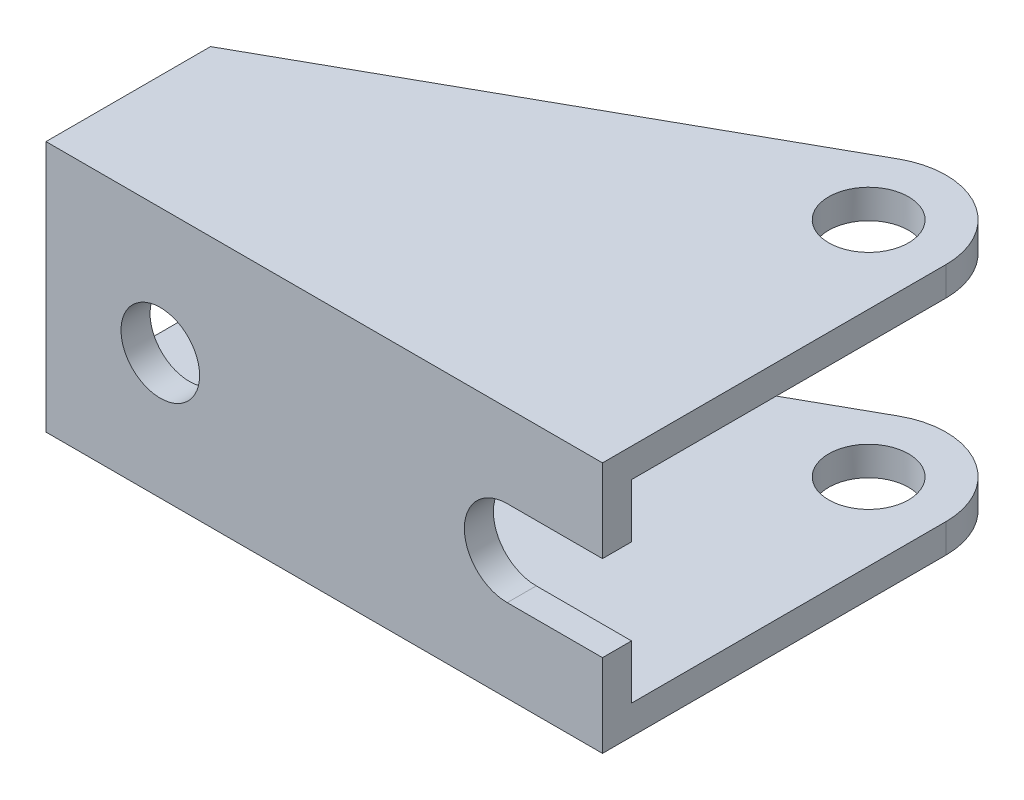
ISO-10303-21;
HEADER;
FILE_DESCRIPTION(('STEP AP214'),'2;1');
FILE_NAME('part.step','',(''),(''),'','','');
FILE_SCHEMA(('AUTOMOTIVE_DESIGN { 1 0 10303 214 1 1 1 1 }'));
ENDSEC;
DATA;
#1=APPLICATION_CONTEXT('core data for automotive mechanical design processes');
#2=APPLICATION_PROTOCOL_DEFINITION('international standard','automotive_design',2000,#1);
#3=PRODUCT_CONTEXT('',#1,'mechanical');
#4=PRODUCT('Part','Part','',(#3));
#5=PRODUCT_RELATED_PRODUCT_CATEGORY('part','',(#4));
#6=PRODUCT_DEFINITION_FORMATION('','',#4);
#7=PRODUCT_DEFINITION_CONTEXT('part definition',#1,'design');
#8=PRODUCT_DEFINITION('design','',#6,#7);
#9=PRODUCT_DEFINITION_SHAPE('','',#8);
#10=(LENGTH_UNIT() NAMED_UNIT(*) SI_UNIT(.MILLI.,.METRE.));
#11=(NAMED_UNIT(*) PLANE_ANGLE_UNIT() SI_UNIT($,.RADIAN.));
#12=(NAMED_UNIT(*) SI_UNIT($,.STERADIAN.) SOLID_ANGLE_UNIT());
#13=UNCERTAINTY_MEASURE_WITH_UNIT(LENGTH_MEASURE(1.E-05),#10,'distance_accuracy_value','');
#14=(GEOMETRIC_REPRESENTATION_CONTEXT(3) GLOBAL_UNCERTAINTY_ASSIGNED_CONTEXT((#13)) GLOBAL_UNIT_ASSIGNED_CONTEXT((#10,
#11,#12)) REPRESENTATION_CONTEXT('',''));
#15=CARTESIAN_POINT('',(0.,0.,0.));
#16=DIRECTION('',(0.,0.,1.));
#17=DIRECTION('',(1.,0.,0.));
#18=AXIS2_PLACEMENT_3D('',#15,#16,#17);
#19=CARTESIAN_POINT('',(0.,-26.416,0.));
#20=DIRECTION('',(-1.,0.,0.));
#21=DIRECTION('',(0.,0.,1.));
#22=AXIS2_PLACEMENT_3D('',#19,#20,#21);
#23=PLANE('',#22);
#24=DIRECTION('',(0.,0.,1.));
#25=VECTOR('',#24,1.);
#26=CARTESIAN_POINT('',(0.,-17.708,-44.197));
#27=LINE('',#26,#25);
#28=CARTESIAN_POINT('',(0.,-17.708,-3.048));
#29=VERTEX_POINT('',#28);
#30=CARTESIAN_POINT('',(0.,-17.708,0.));
#31=VERTEX_POINT('',#30);
#32=EDGE_CURVE('E148',#29,#31,#27,.T.);
#33=ORIENTED_EDGE('',*,*,#32,.T.);
#34=DIRECTION('',(0.,1.,0.));
#35=VECTOR('',#34,1.);
#36=CARTESIAN_POINT('',(0.,-26.416,0.));
#37=LINE('',#36,#35);
#38=CARTESIAN_POINT('',(0.,-26.416,0.));
#39=VERTEX_POINT('',#38);
#40=EDGE_CURVE('E11',#39,#31,#37,.T.);
#41=ORIENTED_EDGE('',*,*,#40,.F.);
#42=DIRECTION('',(0.,0.,1.));
#43=VECTOR('',#42,1.);
#44=CARTESIAN_POINT('',(0.,-26.416,0.));
#45=LINE('',#44,#43);
#46=CARTESIAN_POINT('',(0.,-26.416,-36.068));
#47=VERTEX_POINT('',#46);
#48=EDGE_CURVE('E179',#47,#39,#45,.T.);
#49=ORIENTED_EDGE('',*,*,#48,.F.);
#50=DIRECTION('',(0.,1.,0.));
#51=VECTOR('',#50,1.);
#52=CARTESIAN_POINT('',(0.,-26.416,-36.068));
#53=LINE('',#52,#51);
#54=CARTESIAN_POINT('',(0.,-23.368,-36.068));
#55=VERTEX_POINT('',#54);
#56=EDGE_CURVE('E39',#47,#55,#53,.T.);
#57=ORIENTED_EDGE('',*,*,#56,.T.);
#58=DIRECTION('',(0.,0.,-1.));
#59=VECTOR('',#58,1.);
#60=CARTESIAN_POINT('',(0.,-23.368,-3.048));
#61=LINE('',#60,#59);
#62=CARTESIAN_POINT('',(0.,-23.368,-3.048));
#63=VERTEX_POINT('',#62);
#64=EDGE_CURVE('E60',#63,#55,#61,.T.);
#65=ORIENTED_EDGE('',*,*,#64,.F.);
#66=DIRECTION('',(0.,-1.,0.));
#67=VECTOR('',#66,1.);
#68=CARTESIAN_POINT('',(0.,-3.048,-3.048));
#69=LINE('',#68,#67);
#70=EDGE_CURVE('E163',#29,#63,#69,.T.);
#71=ORIENTED_EDGE('',*,*,#70,.F.);
#72=EDGE_LOOP('',(#33,#41,#49,#57,#65,#71));
#73=FACE_BOUND('',#72,.T.);
#74=ADVANCED_FACE('F35',(#73),#23,.F.);
#75=CARTESIAN_POINT('',(0.,-26.416,0.));
#76=DIRECTION('',(0.,0.,-1.));
#77=DIRECTION('',(-1.,0.,0.));
#78=AXIS2_PLACEMENT_3D('',#75,#76,#77);
#79=PLANE('',#78);
#80=CARTESIAN_POINT('',(-46.42,-13.208,0.));
#81=DIRECTION('',(0.,0.,1.));
#82=DIRECTION('',(1.,0.,0.));
#83=AXIS2_PLACEMENT_3D('',#80,#81,#82);
#84=CIRCLE('',#83,4.12500000000001);
#85=CARTESIAN_POINT('',(-42.295,-13.208,0.));
#86=VERTEX_POINT('',#85);
#87=EDGE_CURVE('E340',#86,#86,#84,.T.);
#88=ORIENTED_EDGE('',*,*,#87,.F.);
#89=EDGE_LOOP('',(#88));
#90=FACE_BOUND('',#89,.T.);
#91=DIRECTION('',(-1.,0.,0.));
#92=VECTOR('',#91,1.);
#93=CARTESIAN_POINT('',(0.,-17.708,0.));
#94=LINE('',#93,#92);
#95=CARTESIAN_POINT('',(-10.,-17.708,0.));
#96=VERTEX_POINT('',#95);
#97=EDGE_CURVE('E156',#31,#96,#94,.T.);
#98=ORIENTED_EDGE('',*,*,#97,.T.);
#99=CARTESIAN_POINT('',(-10.,-13.208,0.));
#100=DIRECTION('',(0.,0.,1.));
#101=DIRECTION('',(1.,0.,0.));
#102=AXIS2_PLACEMENT_3D('',#99,#100,#101);
#103=CIRCLE('',#102,4.5);
#104=CARTESIAN_POINT('',(-10.,-8.708,0.));
#105=VERTEX_POINT('',#104);
#106=EDGE_CURVE('E325',#105,#96,#103,.T.);
#107=ORIENTED_EDGE('',*,*,#106,.F.);
#108=DIRECTION('',(-1.,0.,0.));
#109=VECTOR('',#108,1.);
#110=CARTESIAN_POINT('',(0.,-8.708,0.));
#111=LINE('',#110,#109);
#112=CARTESIAN_POINT('',(0.,-8.708,0.));
#113=VERTEX_POINT('',#112);
#114=EDGE_CURVE('E323',#113,#105,#111,.T.);
#115=ORIENTED_EDGE('',*,*,#114,.F.);
#116=CARTESIAN_POINT('',(0.,0.,0.));
#117=VERTEX_POINT('',#116);
#118=EDGE_CURVE('E44',#113,#117,#37,.T.);
#119=ORIENTED_EDGE('',*,*,#118,.T.);
#120=DIRECTION('',(-1.,0.,0.));
#121=VECTOR('',#120,1.);
#122=CARTESIAN_POINT('',(0.,0.,0.));
#123=LINE('',#122,#121);
#124=CARTESIAN_POINT('',(-58.42,0.,0.));
#125=VERTEX_POINT('',#124);
#126=EDGE_CURVE('E206',#117,#125,#123,.T.);
#127=ORIENTED_EDGE('',*,*,#126,.T.);
#128=DIRECTION('',(0.,1.,0.));
#129=VECTOR('',#128,1.);
#130=CARTESIAN_POINT('',(-58.42,-26.416,0.));
#131=LINE('',#130,#129);
#132=CARTESIAN_POINT('',(-58.42,-26.416,0.));
#133=VERTEX_POINT('',#132);
#134=EDGE_CURVE('E210',#133,#125,#131,.T.);
#135=ORIENTED_EDGE('',*,*,#134,.F.);
#136=DIRECTION('',(-1.,0.,0.));
#137=VECTOR('',#136,1.);
#138=CARTESIAN_POINT('',(0.,-26.416,0.));
#139=LINE('',#138,#137);
#140=EDGE_CURVE('E190',#39,#133,#139,.T.);
#141=ORIENTED_EDGE('',*,*,#140,.F.);
#142=ORIENTED_EDGE('',*,*,#40,.T.);
#143=EDGE_LOOP('',(#98,#107,#115,#119,#127,#135,#141,#142));
#144=FACE_BOUND('',#143,.T.);
#145=ADVANCED_FACE('F255',(#90,#144),#79,.F.);
#146=CARTESIAN_POINT('',(-58.421,-3.048,-3.048));
#147=DIRECTION('',(0.,0.,1.));
#148=DIRECTION('',(0.,-1.,0.));
#149=AXIS2_PLACEMENT_3D('',#146,#147,#148);
#150=PLANE('',#149);
#151=CARTESIAN_POINT('',(-46.42,-13.208,-3.048));
#152=DIRECTION('',(0.,0.,1.));
#153=DIRECTION('',(0.,-1.,0.));
#154=AXIS2_PLACEMENT_3D('',#151,#152,#153);
#155=CIRCLE('',#154,4.12500000000001);
#156=CARTESIAN_POINT('',(-46.42,-17.333,-3.048));
#157=VERTEX_POINT('',#156);
#158=EDGE_CURVE('E337',#157,#157,#155,.F.);
#159=ORIENTED_EDGE('',*,*,#158,.F.);
#160=EDGE_LOOP('',(#159));
#161=FACE_BOUND('',#160,.T.);
#162=DIRECTION('',(1.,0.,0.));
#163=VECTOR('',#162,1.);
#164=CARTESIAN_POINT('',(0.,-17.708,-3.048));
#165=LINE('',#164,#163);
#166=CARTESIAN_POINT('',(-10.,-17.708,-3.048));
#167=VERTEX_POINT('',#166);
#168=EDGE_CURVE('E326',#167,#29,#165,.T.);
#169=ORIENTED_EDGE('',*,*,#168,.T.);
#170=ORIENTED_EDGE('',*,*,#70,.T.);
#171=DIRECTION('',(1.,0.,0.));
#172=VECTOR('',#171,1.);
#173=CARTESIAN_POINT('',(-58.421,-23.368,-3.048));
#174=LINE('',#173,#172);
#175=CARTESIAN_POINT('',(-58.42,-23.368,-3.048));
#176=VERTEX_POINT('',#175);
#177=EDGE_CURVE('E165',#176,#63,#174,.T.);
#178=ORIENTED_EDGE('',*,*,#177,.F.);
#179=DIRECTION('',(0.,1.,0.));
#180=VECTOR('',#179,1.);
#181=CARTESIAN_POINT('',(-58.42,-3.048,-3.048));
#182=LINE('',#181,#180);
#183=CARTESIAN_POINT('',(-58.42,-3.048,-3.048));
#184=VERTEX_POINT('',#183);
#185=EDGE_CURVE('E171',#176,#184,#182,.T.);
#186=ORIENTED_EDGE('',*,*,#185,.T.);
#187=DIRECTION('',(1.,0.,0.));
#188=VECTOR('',#187,1.);
#189=CARTESIAN_POINT('',(-58.421,-3.048,-3.048));
#190=LINE('',#189,#188);
#191=CARTESIAN_POINT('',(0.,-3.048,-3.048));
#192=VERTEX_POINT('',#191);
#193=EDGE_CURVE('E161',#184,#192,#190,.T.);
#194=ORIENTED_EDGE('',*,*,#193,.T.);
#195=CARTESIAN_POINT('',(0.,-8.708,-3.048));
#196=VERTEX_POINT('',#195);
#197=EDGE_CURVE('E154',#192,#196,#69,.T.);
#198=ORIENTED_EDGE('',*,*,#197,.T.);
#199=DIRECTION('',(1.,0.,0.));
#200=VECTOR('',#199,1.);
#201=CARTESIAN_POINT('',(0.,-8.708,-3.048));
#202=LINE('',#201,#200);
#203=CARTESIAN_POINT('',(-9.99999999999999,-8.708,-3.048));
#204=VERTEX_POINT('',#203);
#205=EDGE_CURVE('E138',#204,#196,#202,.T.);
#206=ORIENTED_EDGE('',*,*,#205,.F.);
#207=CARTESIAN_POINT('',(-10.,-13.208,-3.048));
#208=DIRECTION('',(0.,0.,1.));
#209=DIRECTION('',(0.,-1.,0.));
#210=AXIS2_PLACEMENT_3D('',#207,#208,#209);
#211=CIRCLE('',#210,4.5);
#212=EDGE_CURVE('E52',#167,#204,#211,.F.);
#213=ORIENTED_EDGE('',*,*,#212,.F.);
#214=EDGE_LOOP('',(#169,#170,#178,#186,#194,#198,#206,#213));
#215=FACE_BOUND('',#214,.T.);
#216=ADVANCED_FACE('F159',(#161,#215),#150,.F.);
#217=ORIENTED_EDGE('',*,*,#118,.F.);
#218=DIRECTION('',(0.,0.,1.));
#219=VECTOR('',#218,1.);
#220=CARTESIAN_POINT('',(0.,-8.708,-44.197));
#221=LINE('',#220,#219);
#222=EDGE_CURVE('E142',#196,#113,#221,.T.);
#223=ORIENTED_EDGE('',*,*,#222,.F.);
#224=ORIENTED_EDGE('',*,*,#197,.F.);
#225=DIRECTION('',(0.,0.,-1.));
#226=VECTOR('',#225,1.);
#227=CARTESIAN_POINT('',(0.,-3.048,-3.048));
#228=LINE('',#227,#226);
#229=CARTESIAN_POINT('',(0.,-3.048,-36.068));
#230=VERTEX_POINT('',#229);
#231=EDGE_CURVE('E230',#192,#230,#228,.T.);
#232=ORIENTED_EDGE('',*,*,#231,.T.);
#233=CARTESIAN_POINT('',(0.,0.,-36.068));
#234=VERTEX_POINT('',#233);
#235=EDGE_CURVE('E195',#230,#234,#53,.T.);
#236=ORIENTED_EDGE('',*,*,#235,.T.);
#237=DIRECTION('',(0.,0.,1.));
#238=VECTOR('',#237,1.);
#239=CARTESIAN_POINT('',(0.,0.,0.));
#240=LINE('',#239,#238);
#241=EDGE_CURVE('E178',#234,#117,#240,.T.);
#242=ORIENTED_EDGE('',*,*,#241,.T.);
#243=EDGE_LOOP('',(#217,#223,#224,#232,#236,#242));
#244=FACE_BOUND('',#243,.T.);
#245=ADVANCED_FACE('F37',(#244),#23,.F.);
#246=CARTESIAN_POINT('',(-58.42,-26.416,0.));
#247=DIRECTION('',(1.,0.,0.));
#248=DIRECTION('',(0.,0.,-1.));
#249=AXIS2_PLACEMENT_3D('',#246,#247,#248);
#250=PLANE('',#249);
#251=DIRECTION('',(0.,0.,1.));
#252=VECTOR('',#251,1.);
#253=CARTESIAN_POINT('',(-58.42,-3.048,-3.048));
#254=LINE('',#253,#252);
#255=CARTESIAN_POINT('',(-58.42,-3.04800000000001,-17.272));
#256=VERTEX_POINT('',#255);
#257=EDGE_CURVE('E305',#256,#184,#254,.T.);
#258=ORIENTED_EDGE('',*,*,#257,.T.);
#259=ORIENTED_EDGE('',*,*,#185,.F.);
#260=DIRECTION('',(0.,0.,1.));
#261=VECTOR('',#260,1.);
#262=CARTESIAN_POINT('',(-58.42,-23.368,-3.048));
#263=LINE('',#262,#261);
#264=CARTESIAN_POINT('',(-58.42,-23.368,-17.272));
#265=VERTEX_POINT('',#264);
#266=EDGE_CURVE('E303',#265,#176,#263,.T.);
#267=ORIENTED_EDGE('',*,*,#266,.F.);
#268=DIRECTION('',(0.,1.,0.));
#269=VECTOR('',#268,1.);
#270=CARTESIAN_POINT('',(-58.42,-26.416,-17.272));
#271=LINE('',#270,#269);
#272=CARTESIAN_POINT('',(-58.42,-26.416,-17.272));
#273=VERTEX_POINT('',#272);
#274=EDGE_CURVE('E213',#273,#265,#271,.T.);
#275=ORIENTED_EDGE('',*,*,#274,.F.);
#276=DIRECTION('',(0.,0.,-1.));
#277=VECTOR('',#276,1.);
#278=CARTESIAN_POINT('',(-58.42,-26.416,0.));
#279=LINE('',#278,#277);
#280=EDGE_CURVE('E188',#133,#273,#279,.T.);
#281=ORIENTED_EDGE('',*,*,#280,.F.);
#282=ORIENTED_EDGE('',*,*,#134,.T.);
#283=DIRECTION('',(0.,0.,-1.));
#284=VECTOR('',#283,1.);
#285=CARTESIAN_POINT('',(-58.42,0.,0.));
#286=LINE('',#285,#284);
#287=CARTESIAN_POINT('',(-58.42,0.,-17.272));
#288=VERTEX_POINT('',#287);
#289=EDGE_CURVE('E203',#125,#288,#286,.T.);
#290=ORIENTED_EDGE('',*,*,#289,.T.);
#291=EDGE_CURVE('E215',#256,#288,#271,.T.);
#292=ORIENTED_EDGE('',*,*,#291,.F.);
#293=EDGE_LOOP('',(#258,#259,#267,#275,#281,#282,#290,#292));
#294=FACE_BOUND('',#293,.T.);
#295=ADVANCED_FACE('F250',(#294),#250,.F.);
#296=CARTESIAN_POINT('',(-21.2598914592036,-26.416,-38.0400876442299));
#297=DIRECTION('',(0.487859747744784,0.,0.872922027749556));
#298=DIRECTION('',(0.872922027749556,0.,-0.487859747744784));
#299=AXIS2_PLACEMENT_3D('',#296,#297,#298);
#300=PLANE('',#299);
#301=DIRECTION('',(-0.872922027749556,0.,0.487859747744784));
#302=VECTOR('',#301,1.);
#303=CARTESIAN_POINT('',(-64.4782447050272,-3.048,-13.8861606700081));
#304=LINE('',#303,#302);
#305=CARTESIAN_POINT('',(-12.0933240296696,-3.04800000000001,-43.1631102415484));
#306=VERTEX_POINT('',#305);
#307=EDGE_CURVE('E315',#306,#256,#304,.T.);
#308=ORIENTED_EDGE('',*,*,#307,.T.);
#309=ORIENTED_EDGE('',*,*,#291,.T.);
#310=DIRECTION('',(0.872922027749556,0.,-0.487859747744784));
#311=VECTOR('',#310,1.);
#312=CARTESIAN_POINT('',(-21.2598914592036,0.,-38.0400876442299));
#313=LINE('',#312,#311);
#314=CARTESIAN_POINT('',(-12.0933240296696,0.,-43.1631102415484));
#315=VERTEX_POINT('',#314);
#316=EDGE_CURVE('E200',#288,#315,#313,.T.);
#317=ORIENTED_EDGE('',*,*,#316,.T.);
#318=DIRECTION('',(0.,1.,0.));
#319=VECTOR('',#318,1.);
#320=CARTESIAN_POINT('',(-12.0933240296696,-26.416,-43.1631102415484));
#321=LINE('',#320,#319);
#322=EDGE_CURVE('E218',#306,#315,#321,.T.);
#323=ORIENTED_EDGE('',*,*,#322,.F.);
#324=EDGE_LOOP('',(#308,#309,#317,#323));
#325=FACE_BOUND('',#324,.T.);
#326=ADVANCED_FACE('F240',(#325),#300,.F.);
#327=CARTESIAN_POINT('',(-8.128,-26.416,-36.068));
#328=DIRECTION('',(0.,1.,0.));
#329=DIRECTION('',(0.,0.,1.));
#330=AXIS2_PLACEMENT_3D('',#327,#328,#329);
#331=CYLINDRICAL_SURFACE('',#330,8.128);
#332=ORIENTED_EDGE('',*,*,#235,.F.);
#333=CARTESIAN_POINT('',(-8.128,-3.048,-36.068));
#334=DIRECTION('',(0.,-1.,0.));
#335=DIRECTION('',(0.,0.,-1.));
#336=AXIS2_PLACEMENT_3D('',#333,#334,#335);
#337=CIRCLE('',#336,8.128);
#338=EDGE_CURVE('E306',#306,#230,#337,.T.);
#339=ORIENTED_EDGE('',*,*,#338,.F.);
#340=ORIENTED_EDGE('',*,*,#322,.T.);
#341=CARTESIAN_POINT('',(-8.128,0.,-36.068));
#342=DIRECTION('',(0.,1.,0.));
#343=DIRECTION('',(0.,0.,1.));
#344=AXIS2_PLACEMENT_3D('',#341,#342,#343);
#345=CIRCLE('',#344,8.128);
#346=EDGE_CURVE('E197',#234,#315,#345,.T.);
#347=ORIENTED_EDGE('',*,*,#346,.F.);
#348=EDGE_LOOP('',(#332,#339,#340,#347));
#349=FACE_BOUND('',#348,.T.);
#350=ADVANCED_FACE('F237',(#349),#331,.T.);
#351=CARTESIAN_POINT('',(-8.128,-26.416,-36.068));
#352=DIRECTION('',(0.,1.,0.));
#353=DIRECTION('',(0.,0.,1.));
#354=AXIS2_PLACEMENT_3D('',#351,#352,#353);
#355=CYLINDRICAL_SURFACE('',#354,4.191);
#356=CARTESIAN_POINT('',(-8.128,0.,-36.068));
#357=DIRECTION('',(0.,1.,0.));
#358=DIRECTION('',(0.,0.,1.));
#359=AXIS2_PLACEMENT_3D('',#356,#357,#358);
#360=CIRCLE('',#359,4.191);
#361=CARTESIAN_POINT('',(-8.128,0.,-31.877));
#362=VERTEX_POINT('',#361);
#363=EDGE_CURVE('E183',#362,#362,#360,.T.);
#364=ORIENTED_EDGE('',*,*,#363,.T.);
#365=EDGE_LOOP('',(#364));
#366=FACE_BOUND('',#365,.T.);
#367=CARTESIAN_POINT('',(-8.128,-3.048,-36.068));
#368=DIRECTION('',(0.,-1.,0.));
#369=DIRECTION('',(0.,0.,-1.));
#370=AXIS2_PLACEMENT_3D('',#367,#368,#369);
#371=CIRCLE('',#370,4.191);
#372=CARTESIAN_POINT('',(-8.128,-3.048,-40.259));
#373=VERTEX_POINT('',#372);
#374=EDGE_CURVE('E308',#373,#373,#371,.T.);
#375=ORIENTED_EDGE('',*,*,#374,.T.);
#376=EDGE_LOOP('',(#375));
#377=FACE_BOUND('',#376,.T.);
#378=ADVANCED_FACE('F239',(#366,#377),#355,.F.);
#379=ORIENTED_EDGE('',*,*,#274,.T.);
#380=DIRECTION('',(-0.872922027749556,0.,0.487859747744784));
#381=VECTOR('',#380,1.);
#382=CARTESIAN_POINT('',(-64.4782447050272,-23.368,-13.8861606700081));
#383=LINE('',#382,#381);
#384=CARTESIAN_POINT('',(-12.0933240296696,-23.368,-43.1631102415484));
#385=VERTEX_POINT('',#384);
#386=EDGE_CURVE('E176',#385,#265,#383,.T.);
#387=ORIENTED_EDGE('',*,*,#386,.F.);
#388=CARTESIAN_POINT('',(-12.0933240296696,-26.416,-43.1631102415484));
#389=VERTEX_POINT('',#388);
#390=EDGE_CURVE('E216',#389,#385,#321,.T.);
#391=ORIENTED_EDGE('',*,*,#390,.F.);
#392=DIRECTION('',(0.872922027749556,0.,-0.487859747744784));
#393=VECTOR('',#392,1.);
#394=CARTESIAN_POINT('',(-21.2598914592036,-26.416,-38.0400876442299));
#395=LINE('',#394,#393);
#396=EDGE_CURVE('E186',#273,#389,#395,.T.);
#397=ORIENTED_EDGE('',*,*,#396,.F.);
#398=EDGE_LOOP('',(#379,#387,#391,#397));
#399=FACE_BOUND('',#398,.T.);
#400=ADVANCED_FACE('F246',(#399),#300,.F.);
#401=CARTESIAN_POINT('',(-8.128,-23.368,-36.068));
#402=DIRECTION('',(0.,-1.,0.));
#403=DIRECTION('',(0.,0.,-1.));
#404=AXIS2_PLACEMENT_3D('',#401,#402,#403);
#405=CIRCLE('',#404,8.128);
#406=EDGE_CURVE('E147',#385,#55,#405,.T.);
#407=ORIENTED_EDGE('',*,*,#406,.T.);
#408=ORIENTED_EDGE('',*,*,#56,.F.);
#409=CARTESIAN_POINT('',(-8.128,-26.416,-36.068));
#410=DIRECTION('',(0.,1.,0.));
#411=DIRECTION('',(0.,0.,1.));
#412=AXIS2_PLACEMENT_3D('',#409,#410,#411);
#413=CIRCLE('',#412,8.128);
#414=EDGE_CURVE('E182',#47,#389,#413,.T.);
#415=ORIENTED_EDGE('',*,*,#414,.T.);
#416=ORIENTED_EDGE('',*,*,#390,.T.);
#417=EDGE_LOOP('',(#407,#408,#415,#416));
#418=FACE_BOUND('',#417,.T.);
#419=ADVANCED_FACE('F241',(#418),#331,.T.);
#420=CARTESIAN_POINT('',(-8.128,-23.368,-36.068));
#421=DIRECTION('',(0.,-1.,0.));
#422=DIRECTION('',(0.,0.,-1.));
#423=AXIS2_PLACEMENT_3D('',#420,#421,#422);
#424=CIRCLE('',#423,4.191);
#425=CARTESIAN_POINT('',(-8.128,-23.368,-40.259));
#426=VERTEX_POINT('',#425);
#427=EDGE_CURVE('E173',#426,#426,#424,.T.);
#428=ORIENTED_EDGE('',*,*,#427,.F.);
#429=EDGE_LOOP('',(#428));
#430=FACE_BOUND('',#429,.T.);
#431=CARTESIAN_POINT('',(-8.128,-26.416,-36.068));
#432=DIRECTION('',(0.,1.,0.));
#433=DIRECTION('',(0.,0.,1.));
#434=AXIS2_PLACEMENT_3D('',#431,#432,#433);
#435=CIRCLE('',#434,4.191);
#436=CARTESIAN_POINT('',(-8.128,-26.416,-31.877));
#437=VERTEX_POINT('',#436);
#438=EDGE_CURVE('E192',#437,#437,#435,.T.);
#439=ORIENTED_EDGE('',*,*,#438,.F.);
#440=EDGE_LOOP('',(#439));
#441=FACE_BOUND('',#440,.T.);
#442=ADVANCED_FACE('F249',(#430,#441),#355,.F.);
#443=CARTESIAN_POINT('',(0.,-26.416,0.));
#444=DIRECTION('',(0.,1.,0.));
#445=DIRECTION('',(0.,0.,1.));
#446=AXIS2_PLACEMENT_3D('',#443,#444,#445);
#447=PLANE('',#446);
#448=ORIENTED_EDGE('',*,*,#48,.T.);
#449=ORIENTED_EDGE('',*,*,#140,.T.);
#450=ORIENTED_EDGE('',*,*,#280,.T.);
#451=ORIENTED_EDGE('',*,*,#396,.T.);
#452=ORIENTED_EDGE('',*,*,#414,.F.);
#453=EDGE_LOOP('',(#448,#449,#450,#451,#452));
#454=FACE_BOUND('',#453,.T.);
#455=ORIENTED_EDGE('',*,*,#438,.T.);
#456=EDGE_LOOP('',(#455));
#457=FACE_BOUND('',#456,.T.);
#458=ADVANCED_FACE('F285',(#454,#457),#447,.F.);
#459=CARTESIAN_POINT('',(0.,0.,0.));
#460=DIRECTION('',(0.,1.,0.));
#461=DIRECTION('',(0.,0.,1.));
#462=AXIS2_PLACEMENT_3D('',#459,#460,#461);
#463=PLANE('',#462);
#464=ORIENTED_EDGE('',*,*,#241,.F.);
#465=ORIENTED_EDGE('',*,*,#346,.T.);
#466=ORIENTED_EDGE('',*,*,#316,.F.);
#467=ORIENTED_EDGE('',*,*,#289,.F.);
#468=ORIENTED_EDGE('',*,*,#126,.F.);
#469=EDGE_LOOP('',(#464,#465,#466,#467,#468));
#470=FACE_BOUND('',#469,.T.);
#471=ORIENTED_EDGE('',*,*,#363,.F.);
#472=EDGE_LOOP('',(#471));
#473=FACE_BOUND('',#472,.T.);
#474=ADVANCED_FACE('F233',(#470,#473),#463,.T.);
#475=CARTESIAN_POINT('',(-58.421,-3.048,-3.048));
#476=DIRECTION('',(0.,-1.,0.));
#477=DIRECTION('',(0.,0.,-1.));
#478=AXIS2_PLACEMENT_3D('',#475,#476,#477);
#479=PLANE('',#478);
#480=ORIENTED_EDGE('',*,*,#374,.F.);
#481=EDGE_LOOP('',(#480));
#482=FACE_BOUND('',#481,.T.);
#483=ORIENTED_EDGE('',*,*,#307,.F.);
#484=ORIENTED_EDGE('',*,*,#338,.T.);
#485=ORIENTED_EDGE('',*,*,#231,.F.);
#486=ORIENTED_EDGE('',*,*,#193,.F.);
#487=ORIENTED_EDGE('',*,*,#257,.F.);
#488=EDGE_LOOP('',(#483,#484,#485,#486,#487));
#489=FACE_BOUND('',#488,.T.);
#490=ADVANCED_FACE('F281',(#482,#489),#479,.T.);
#491=CARTESIAN_POINT('',(-58.421,-23.368,-3.048));
#492=DIRECTION('',(0.,-1.,0.));
#493=DIRECTION('',(0.,0.,-1.));
#494=AXIS2_PLACEMENT_3D('',#491,#492,#493);
#495=PLANE('',#494);
#496=ORIENTED_EDGE('',*,*,#266,.T.);
#497=ORIENTED_EDGE('',*,*,#177,.T.);
#498=ORIENTED_EDGE('',*,*,#64,.T.);
#499=ORIENTED_EDGE('',*,*,#406,.F.);
#500=ORIENTED_EDGE('',*,*,#386,.T.);
#501=EDGE_LOOP('',(#496,#497,#498,#499,#500));
#502=FACE_BOUND('',#501,.T.);
#503=ORIENTED_EDGE('',*,*,#427,.T.);
#504=EDGE_LOOP('',(#503));
#505=FACE_BOUND('',#504,.T.);
#506=ADVANCED_FACE('F278',(#502,#505),#495,.F.);
#507=CARTESIAN_POINT('',(-46.42,-13.208,-44.197));
#508=DIRECTION('',(0.,0.,1.));
#509=DIRECTION('',(1.,0.,0.));
#510=AXIS2_PLACEMENT_3D('',#507,#508,#509);
#511=CYLINDRICAL_SURFACE('',#510,4.12500000000001);
#512=ORIENTED_EDGE('',*,*,#87,.T.);
#513=EDGE_LOOP('',(#512));
#514=FACE_BOUND('',#513,.T.);
#515=ORIENTED_EDGE('',*,*,#158,.T.);
#516=EDGE_LOOP('',(#515));
#517=FACE_BOUND('',#516,.T.);
#518=ADVANCED_FACE('F276',(#514,#517),#511,.F.);
#519=CARTESIAN_POINT('',(0.,-17.708,-44.197));
#520=DIRECTION('',(0.,1.,0.));
#521=DIRECTION('',(0.,0.,1.));
#522=AXIS2_PLACEMENT_3D('',#519,#520,#521);
#523=PLANE('',#522);
#524=DIRECTION('',(0.,0.,1.));
#525=VECTOR('',#524,1.);
#526=CARTESIAN_POINT('',(-10.,-17.708,-44.197));
#527=LINE('',#526,#525);
#528=EDGE_CURVE('E334',#167,#96,#527,.T.);
#529=ORIENTED_EDGE('',*,*,#528,.T.);
#530=ORIENTED_EDGE('',*,*,#97,.F.);
#531=ORIENTED_EDGE('',*,*,#32,.F.);
#532=ORIENTED_EDGE('',*,*,#168,.F.);
#533=EDGE_LOOP('',(#529,#530,#531,#532));
#534=FACE_BOUND('',#533,.T.);
#535=ADVANCED_FACE('F351',(#534),#523,.T.);
#536=CARTESIAN_POINT('',(-10.,-13.208,-44.197));
#537=DIRECTION('',(0.,0.,1.));
#538=DIRECTION('',(1.,0.,0.));
#539=AXIS2_PLACEMENT_3D('',#536,#537,#538);
#540=CYLINDRICAL_SURFACE('',#539,4.5);
#541=ORIENTED_EDGE('',*,*,#212,.T.);
#542=DIRECTION('',(0.,0.,1.));
#543=VECTOR('',#542,1.);
#544=CARTESIAN_POINT('',(-10.,-8.708,-44.197));
#545=LINE('',#544,#543);
#546=EDGE_CURVE('E144',#204,#105,#545,.T.);
#547=ORIENTED_EDGE('',*,*,#546,.T.);
#548=ORIENTED_EDGE('',*,*,#106,.T.);
#549=ORIENTED_EDGE('',*,*,#528,.F.);
#550=EDGE_LOOP('',(#541,#547,#548,#549));
#551=FACE_BOUND('',#550,.T.);
#552=ADVANCED_FACE('F353',(#551),#540,.F.);
#553=CARTESIAN_POINT('',(0.,-8.708,-44.197));
#554=DIRECTION('',(0.,1.,0.));
#555=DIRECTION('',(0.,0.,1.));
#556=AXIS2_PLACEMENT_3D('',#553,#554,#555);
#557=PLANE('',#556);
#558=ORIENTED_EDGE('',*,*,#205,.T.);
#559=ORIENTED_EDGE('',*,*,#222,.T.);
#560=ORIENTED_EDGE('',*,*,#114,.T.);
#561=ORIENTED_EDGE('',*,*,#546,.F.);
#562=EDGE_LOOP('',(#558,#559,#560,#561));
#563=FACE_BOUND('',#562,.T.);
#564=ADVANCED_FACE('F140',(#563),#557,.F.);
#565=CLOSED_SHELL('',(#74,#145,#216,#245,#295,#326,#350,#378,#400,#419,#442,#458,#474,#490,#506,
#518,#535,#552,#564));
#566=MANIFOLD_SOLID_BREP('B2',#565);
#567=ADVANCED_BREP_SHAPE_REPRESENTATION('',(#18,#566),#14);
#568=SHAPE_DEFINITION_REPRESENTATION(#9,#567);
ENDSEC;
END-ISO-10303-21;
